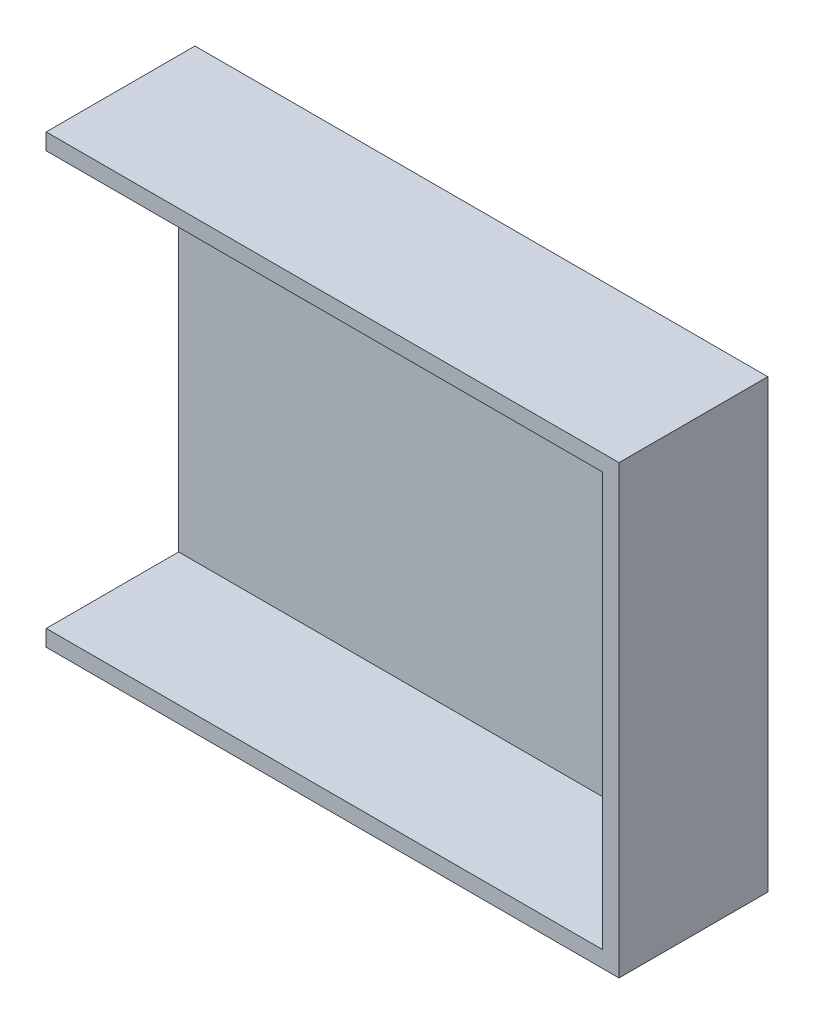
ISO-10303-21;
HEADER;
FILE_DESCRIPTION(('STEP AP214'),'2;1');
FILE_NAME('part.step','',(''),(''),'','','');
FILE_SCHEMA(('AUTOMOTIVE_DESIGN { 1 0 10303 214 1 1 1 1 }'));
ENDSEC;
DATA;
#1=APPLICATION_CONTEXT('core data for automotive mechanical design processes');
#2=APPLICATION_PROTOCOL_DEFINITION('international standard','automotive_design',2000,#1);
#3=PRODUCT_CONTEXT('',#1,'mechanical');
#4=PRODUCT('Part','Part','',(#3));
#5=PRODUCT_RELATED_PRODUCT_CATEGORY('part','',(#4));
#6=PRODUCT_DEFINITION_FORMATION('','',#4);
#7=PRODUCT_DEFINITION_CONTEXT('part definition',#1,'design');
#8=PRODUCT_DEFINITION('design','',#6,#7);
#9=PRODUCT_DEFINITION_SHAPE('','',#8);
#10=(LENGTH_UNIT() NAMED_UNIT(*) SI_UNIT(.MILLI.,.METRE.));
#11=(NAMED_UNIT(*) PLANE_ANGLE_UNIT() SI_UNIT($,.RADIAN.));
#12=(NAMED_UNIT(*) SI_UNIT($,.STERADIAN.) SOLID_ANGLE_UNIT());
#13=UNCERTAINTY_MEASURE_WITH_UNIT(LENGTH_MEASURE(1.E-05),#10,'distance_accuracy_value','');
#14=(GEOMETRIC_REPRESENTATION_CONTEXT(3) GLOBAL_UNCERTAINTY_ASSIGNED_CONTEXT((#13)) GLOBAL_UNIT_ASSIGNED_CONTEXT((#10,
#11,#12)) REPRESENTATION_CONTEXT('',''));
#15=CARTESIAN_POINT('',(0.,0.,0.));
#16=DIRECTION('',(0.,0.,1.));
#17=DIRECTION('',(1.,0.,0.));
#18=AXIS2_PLACEMENT_3D('',#15,#16,#17);
#19=CARTESIAN_POINT('',(79.6422171945702,-190.5,50.8));
#20=DIRECTION('',(0.,1.,0.));
#21=DIRECTION('',(0.,0.,1.));
#22=AXIS2_PLACEMENT_3D('',#19,#20,#21);
#23=PLANE('',#22);
#24=DIRECTION('',(1.,0.,0.));
#25=VECTOR('',#24,1.);
#26=CARTESIAN_POINT('',(79.6422171945702,-190.5,0.));
#27=LINE('',#26,#25);
#28=CARTESIAN_POINT('',(-115.93778280543,-190.5,0.));
#29=VERTEX_POINT('',#28);
#30=CARTESIAN_POINT('',(79.6422171945702,-190.5,0.));
#31=VERTEX_POINT('',#30);
#32=EDGE_CURVE('E175',#29,#31,#27,.T.);
#33=ORIENTED_EDGE('',*,*,#32,.T.);
#34=DIRECTION('',(0.,0.,-1.));
#35=VECTOR('',#34,1.);
#36=CARTESIAN_POINT('',(79.6422171945702,-190.5,50.8));
#37=LINE('',#36,#35);
#38=CARTESIAN_POINT('',(79.6422171945702,-190.5,50.8));
#39=VERTEX_POINT('',#38);
#40=EDGE_CURVE('E11',#39,#31,#37,.T.);
#41=ORIENTED_EDGE('',*,*,#40,.F.);
#42=DIRECTION('',(1.,0.,0.));
#43=VECTOR('',#42,1.);
#44=CARTESIAN_POINT('',(79.6422171945702,-190.5,50.8));
#45=LINE('',#44,#43);
#46=CARTESIAN_POINT('',(-115.93778280543,-190.5,50.8));
#47=VERTEX_POINT('',#46);
#48=EDGE_CURVE('E162',#47,#39,#45,.T.);
#49=ORIENTED_EDGE('',*,*,#48,.F.);
#50=DIRECTION('',(0.,0.,-1.));
#51=VECTOR('',#50,1.);
#52=CARTESIAN_POINT('',(-115.93778280543,-190.5,50.8));
#53=LINE('',#52,#51);
#54=EDGE_CURVE('E174',#47,#29,#53,.T.);
#55=ORIENTED_EDGE('',*,*,#54,.T.);
#56=EDGE_LOOP('',(#33,#41,#49,#55));
#57=FACE_BOUND('',#56,.T.);
#58=ADVANCED_FACE('F45',(#57),#23,.F.);
#59=CARTESIAN_POINT('',(79.6422171945701,-38.1,50.8));
#60=DIRECTION('',(-1.,0.,0.));
#61=DIRECTION('',(0.,-1.,0.));
#62=AXIS2_PLACEMENT_3D('',#59,#60,#61);
#63=PLANE('',#62);
#64=DIRECTION('',(0.,1.,0.));
#65=VECTOR('',#64,1.);
#66=CARTESIAN_POINT('',(79.6422171945701,-38.1,0.));
#67=LINE('',#66,#65);
#68=CARTESIAN_POINT('',(79.6422171945701,-38.1,0.));
#69=VERTEX_POINT('',#68);
#70=EDGE_CURVE('E179',#31,#69,#67,.T.);
#71=ORIENTED_EDGE('',*,*,#70,.T.);
#72=DIRECTION('',(0.,0.,-1.));
#73=VECTOR('',#72,1.);
#74=CARTESIAN_POINT('',(79.6422171945701,-38.1,50.8));
#75=LINE('',#74,#73);
#76=CARTESIAN_POINT('',(79.6422171945701,-38.1,50.8));
#77=VERTEX_POINT('',#76);
#78=EDGE_CURVE('E53',#77,#69,#75,.T.);
#79=ORIENTED_EDGE('',*,*,#78,.F.);
#80=DIRECTION('',(0.,1.,0.));
#81=VECTOR('',#80,1.);
#82=CARTESIAN_POINT('',(79.6422171945701,-38.1,50.8));
#83=LINE('',#82,#81);
#84=EDGE_CURVE('E98',#39,#77,#83,.T.);
#85=ORIENTED_EDGE('',*,*,#84,.F.);
#86=ORIENTED_EDGE('',*,*,#40,.T.);
#87=EDGE_LOOP('',(#71,#79,#85,#86));
#88=FACE_BOUND('',#87,.T.);
#89=ADVANCED_FACE('F225',(#88),#63,.F.);
#90=CARTESIAN_POINT('',(79.6422171945701,-38.1,50.8));
#91=DIRECTION('',(0.,-1.,0.));
#92=DIRECTION('',(0.,0.,-1.));
#93=AXIS2_PLACEMENT_3D('',#90,#91,#92);
#94=PLANE('',#93);
#95=DIRECTION('',(-1.,0.,0.));
#96=VECTOR('',#95,1.);
#97=CARTESIAN_POINT('',(79.6422171945701,-38.1,0.));
#98=LINE('',#97,#96);
#99=CARTESIAN_POINT('',(-115.93778280543,-38.1,0.));
#100=VERTEX_POINT('',#99);
#101=EDGE_CURVE('E182',#69,#100,#98,.T.);
#102=ORIENTED_EDGE('',*,*,#101,.T.);
#103=DIRECTION('',(0.,0.,-1.));
#104=VECTOR('',#103,1.);
#105=CARTESIAN_POINT('',(-115.93778280543,-38.1,50.8));
#106=LINE('',#105,#104);
#107=CARTESIAN_POINT('',(-115.93778280543,-38.1,50.8));
#108=VERTEX_POINT('',#107);
#109=EDGE_CURVE('E189',#108,#100,#106,.T.);
#110=ORIENTED_EDGE('',*,*,#109,.F.);
#111=DIRECTION('',(-1.,0.,0.));
#112=VECTOR('',#111,1.);
#113=CARTESIAN_POINT('',(79.6422171945701,-38.1,50.8));
#114=LINE('',#113,#112);
#115=EDGE_CURVE('E167',#77,#108,#114,.T.);
#116=ORIENTED_EDGE('',*,*,#115,.F.);
#117=ORIENTED_EDGE('',*,*,#78,.T.);
#118=EDGE_LOOP('',(#102,#110,#116,#117));
#119=FACE_BOUND('',#118,.T.);
#120=ADVANCED_FACE('F196',(#119),#94,.F.);
#121=CARTESIAN_POINT('',(-115.93778280543,-38.1,50.8));
#122=DIRECTION('',(1.,0.,0.));
#123=DIRECTION('',(0.,1.,0.));
#124=AXIS2_PLACEMENT_3D('',#121,#122,#123);
#125=PLANE('',#124);
#126=DIRECTION('',(0.,-1.,0.));
#127=VECTOR('',#126,1.);
#128=CARTESIAN_POINT('',(-115.93778280543,-38.1,50.8));
#129=LINE('',#128,#127);
#130=CARTESIAN_POINT('',(-115.93778280543,-184.912,50.8));
#131=VERTEX_POINT('',#130);
#132=EDGE_CURVE('E69',#131,#47,#129,.T.);
#133=ORIENTED_EDGE('',*,*,#132,.F.);
#134=DIRECTION('',(0.,0.,-1.));
#135=VECTOR('',#134,1.);
#136=CARTESIAN_POINT('',(-115.93778280543,-184.912,50.8));
#137=LINE('',#136,#135);
#138=CARTESIAN_POINT('',(-115.93778280543,-184.912,5.588));
#139=VERTEX_POINT('',#138);
#140=EDGE_CURVE('E156',#131,#139,#137,.T.);
#141=ORIENTED_EDGE('',*,*,#140,.T.);
#142=DIRECTION('',(0.,-1.,0.));
#143=VECTOR('',#142,1.);
#144=CARTESIAN_POINT('',(-115.93778280543,-38.1,5.588));
#145=LINE('',#144,#143);
#146=CARTESIAN_POINT('',(-115.93778280543,-43.688,5.588));
#147=VERTEX_POINT('',#146);
#148=EDGE_CURVE('E143',#147,#139,#145,.T.);
#149=ORIENTED_EDGE('',*,*,#148,.F.);
#150=DIRECTION('',(0.,0.,-1.));
#151=VECTOR('',#150,1.);
#152=CARTESIAN_POINT('',(-115.93778280543,-43.688,50.8));
#153=LINE('',#152,#151);
#154=CARTESIAN_POINT('',(-115.93778280543,-43.688,50.8));
#155=VERTEX_POINT('',#154);
#156=EDGE_CURVE('E137',#155,#147,#153,.T.);
#157=ORIENTED_EDGE('',*,*,#156,.F.);
#158=EDGE_CURVE('E170',#108,#155,#129,.T.);
#159=ORIENTED_EDGE('',*,*,#158,.F.);
#160=ORIENTED_EDGE('',*,*,#109,.T.);
#161=DIRECTION('',(0.,-1.,0.));
#162=VECTOR('',#161,1.);
#163=CARTESIAN_POINT('',(-115.93778280543,-38.1,0.));
#164=LINE('',#163,#162);
#165=EDGE_CURVE('E91',#100,#29,#164,.T.);
#166=ORIENTED_EDGE('',*,*,#165,.T.);
#167=ORIENTED_EDGE('',*,*,#54,.F.);
#168=EDGE_LOOP('',(#133,#141,#149,#157,#159,#160,#166,#167));
#169=FACE_BOUND('',#168,.T.);
#170=ADVANCED_FACE('F204',(#169),#125,.F.);
#171=CARTESIAN_POINT('',(0.,0.,50.8));
#172=DIRECTION('',(0.,0.,1.));
#173=DIRECTION('',(1.,0.,0.));
#174=AXIS2_PLACEMENT_3D('',#171,#172,#173);
#175=PLANE('',#174);
#176=DIRECTION('',(1.,0.,0.));
#177=VECTOR('',#176,1.);
#178=CARTESIAN_POINT('',(79.6422171945702,-184.912,50.8));
#179=LINE('',#178,#177);
#180=CARTESIAN_POINT('',(74.0542171945702,-184.912,50.8));
#181=VERTEX_POINT('',#180);
#182=EDGE_CURVE('E146',#131,#181,#179,.T.);
#183=ORIENTED_EDGE('',*,*,#182,.F.);
#184=ORIENTED_EDGE('',*,*,#132,.T.);
#185=ORIENTED_EDGE('',*,*,#48,.T.);
#186=ORIENTED_EDGE('',*,*,#84,.T.);
#187=ORIENTED_EDGE('',*,*,#115,.T.);
#188=ORIENTED_EDGE('',*,*,#158,.T.);
#189=DIRECTION('',(-1.,0.,0.));
#190=VECTOR('',#189,1.);
#191=CARTESIAN_POINT('',(79.6422171945701,-43.688,50.8));
#192=LINE('',#191,#190);
#193=CARTESIAN_POINT('',(74.0542171945701,-43.688,50.8));
#194=VERTEX_POINT('',#193);
#195=EDGE_CURVE('E153',#194,#155,#192,.T.);
#196=ORIENTED_EDGE('',*,*,#195,.F.);
#197=DIRECTION('',(0.,1.,0.));
#198=VECTOR('',#197,1.);
#199=CARTESIAN_POINT('',(74.0542171945701,-38.1,50.8));
#200=LINE('',#199,#198);
#201=EDGE_CURVE('E133',#181,#194,#200,.T.);
#202=ORIENTED_EDGE('',*,*,#201,.F.);
#203=EDGE_LOOP('',(#183,#184,#185,#186,#187,#188,#196,#202));
#204=FACE_BOUND('',#203,.T.);
#205=ADVANCED_FACE('F212',(#204),#175,.T.);
#206=CARTESIAN_POINT('',(0.,0.,0.));
#207=DIRECTION('',(0.,0.,1.));
#208=DIRECTION('',(1.,0.,0.));
#209=AXIS2_PLACEMENT_3D('',#206,#207,#208);
#210=PLANE('',#209);
#211=ORIENTED_EDGE('',*,*,#32,.F.);
#212=ORIENTED_EDGE('',*,*,#165,.F.);
#213=ORIENTED_EDGE('',*,*,#101,.F.);
#214=ORIENTED_EDGE('',*,*,#70,.F.);
#215=EDGE_LOOP('',(#211,#212,#213,#214));
#216=FACE_BOUND('',#215,.T.);
#217=ADVANCED_FACE('F200',(#216),#210,.F.);
#218=CARTESIAN_POINT('',(79.6422171945702,-184.912,50.8));
#219=DIRECTION('',(0.,1.,0.));
#220=DIRECTION('',(0.,0.,1.));
#221=AXIS2_PLACEMENT_3D('',#218,#219,#220);
#222=PLANE('',#221);
#223=DIRECTION('',(1.,0.,0.));
#224=VECTOR('',#223,1.);
#225=CARTESIAN_POINT('',(79.6422171945702,-184.912,5.588));
#226=LINE('',#225,#224);
#227=CARTESIAN_POINT('',(74.0542171945702,-184.912,5.588));
#228=VERTEX_POINT('',#227);
#229=EDGE_CURVE('E125',#139,#228,#226,.T.);
#230=ORIENTED_EDGE('',*,*,#229,.F.);
#231=ORIENTED_EDGE('',*,*,#140,.F.);
#232=ORIENTED_EDGE('',*,*,#182,.T.);
#233=DIRECTION('',(0.,0.,-1.));
#234=VECTOR('',#233,1.);
#235=CARTESIAN_POINT('',(74.0542171945702,-184.912,50.8));
#236=LINE('',#235,#234);
#237=EDGE_CURVE('E136',#181,#228,#236,.T.);
#238=ORIENTED_EDGE('',*,*,#237,.T.);
#239=EDGE_LOOP('',(#230,#231,#232,#238));
#240=FACE_BOUND('',#239,.T.);
#241=ADVANCED_FACE('F211',(#240),#222,.T.);
#242=CARTESIAN_POINT('',(74.0542171945701,-38.1,50.8));
#243=DIRECTION('',(-1.,0.,0.));
#244=DIRECTION('',(0.,-1.,0.));
#245=AXIS2_PLACEMENT_3D('',#242,#243,#244);
#246=PLANE('',#245);
#247=DIRECTION('',(0.,1.,0.));
#248=VECTOR('',#247,1.);
#249=CARTESIAN_POINT('',(74.0542171945701,-38.1,5.588));
#250=LINE('',#249,#248);
#251=CARTESIAN_POINT('',(74.0542171945701,-43.688,5.588));
#252=VERTEX_POINT('',#251);
#253=EDGE_CURVE('E120',#228,#252,#250,.T.);
#254=ORIENTED_EDGE('',*,*,#253,.F.);
#255=ORIENTED_EDGE('',*,*,#237,.F.);
#256=ORIENTED_EDGE('',*,*,#201,.T.);
#257=DIRECTION('',(0.,0.,-1.));
#258=VECTOR('',#257,1.);
#259=CARTESIAN_POINT('',(74.0542171945701,-43.688,50.8));
#260=LINE('',#259,#258);
#261=EDGE_CURVE('E60',#194,#252,#260,.T.);
#262=ORIENTED_EDGE('',*,*,#261,.T.);
#263=EDGE_LOOP('',(#254,#255,#256,#262));
#264=FACE_BOUND('',#263,.T.);
#265=ADVANCED_FACE('F131',(#264),#246,.T.);
#266=CARTESIAN_POINT('',(79.6422171945701,-43.688,50.8));
#267=DIRECTION('',(0.,-1.,0.));
#268=DIRECTION('',(0.,0.,-1.));
#269=AXIS2_PLACEMENT_3D('',#266,#267,#268);
#270=PLANE('',#269);
#271=DIRECTION('',(-1.,0.,0.));
#272=VECTOR('',#271,1.);
#273=CARTESIAN_POINT('',(79.6422171945701,-43.688,5.588));
#274=LINE('',#273,#272);
#275=EDGE_CURVE('E122',#252,#147,#274,.T.);
#276=ORIENTED_EDGE('',*,*,#275,.F.);
#277=ORIENTED_EDGE('',*,*,#261,.F.);
#278=ORIENTED_EDGE('',*,*,#195,.T.);
#279=ORIENTED_EDGE('',*,*,#156,.T.);
#280=EDGE_LOOP('',(#276,#277,#278,#279));
#281=FACE_BOUND('',#280,.T.);
#282=ADVANCED_FACE('F139',(#281),#270,.T.);
#283=CARTESIAN_POINT('',(0.,0.,5.588));
#284=DIRECTION('',(0.,0.,1.));
#285=DIRECTION('',(1.,0.,0.));
#286=AXIS2_PLACEMENT_3D('',#283,#284,#285);
#287=PLANE('',#286);
#288=ORIENTED_EDGE('',*,*,#229,.T.);
#289=ORIENTED_EDGE('',*,*,#253,.T.);
#290=ORIENTED_EDGE('',*,*,#275,.T.);
#291=ORIENTED_EDGE('',*,*,#148,.T.);
#292=EDGE_LOOP('',(#288,#289,#290,#291));
#293=FACE_BOUND('',#292,.T.);
#294=ADVANCED_FACE('F121',(#293),#287,.T.);
#295=CLOSED_SHELL('',(#58,#89,#120,#170,#205,#217,#241,#265,#282,#294));
#296=MANIFOLD_SOLID_BREP('B2',#295);
#297=ADVANCED_BREP_SHAPE_REPRESENTATION('',(#18,#296),#14);
#298=SHAPE_DEFINITION_REPRESENTATION(#9,#297);
ENDSEC;
END-ISO-10303-21;
